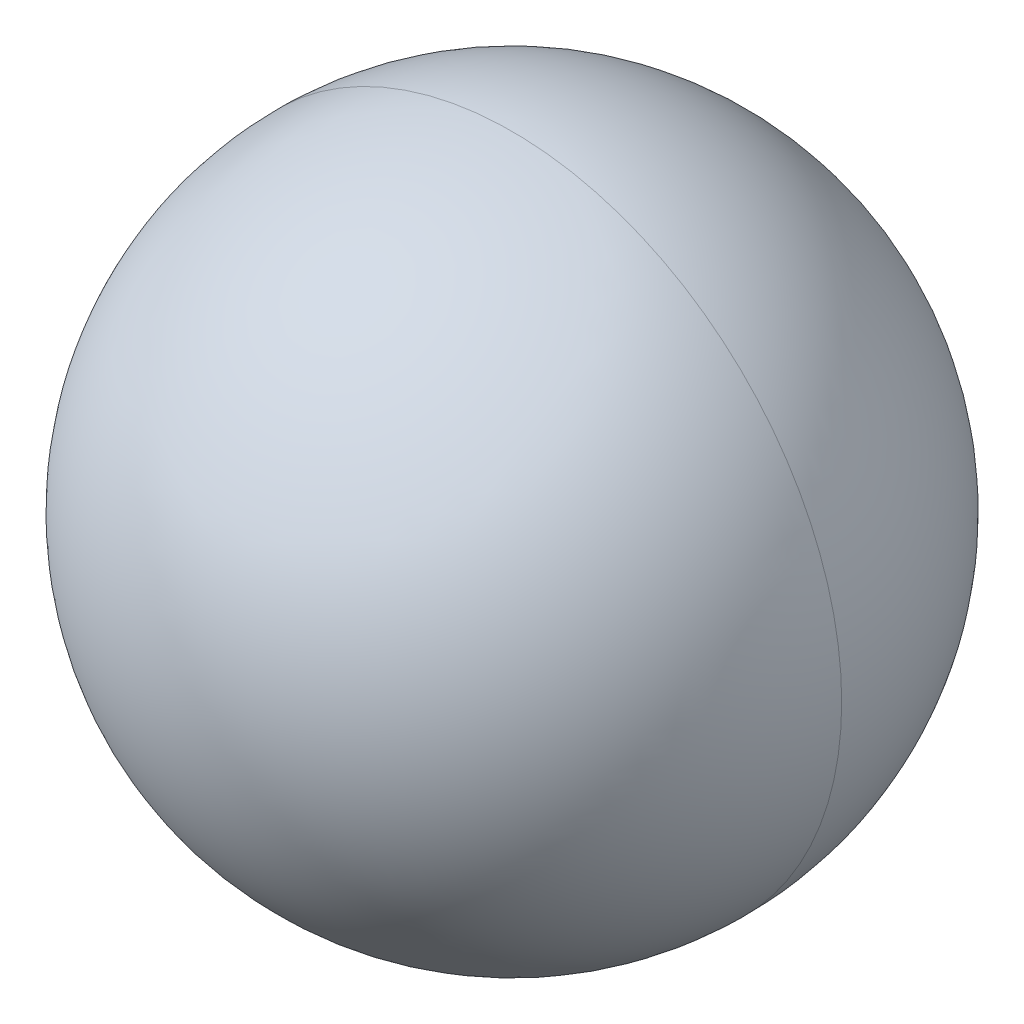
ISO-10303-21;
HEADER;
FILE_DESCRIPTION(('STEP AP214'),'2;1');
FILE_NAME('part.step','',(''),(''),'','','');
FILE_SCHEMA(('AUTOMOTIVE_DESIGN { 1 0 10303 214 1 1 1 1 }'));
ENDSEC;
DATA;
#1=APPLICATION_CONTEXT('core data for automotive mechanical design processes');
#2=APPLICATION_PROTOCOL_DEFINITION('international standard','automotive_design',2000,#1);
#3=PRODUCT_CONTEXT('',#1,'mechanical');
#4=PRODUCT('Part','Part','',(#3));
#5=PRODUCT_RELATED_PRODUCT_CATEGORY('part','',(#4));
#6=PRODUCT_DEFINITION_FORMATION('','',#4);
#7=PRODUCT_DEFINITION_CONTEXT('part definition',#1,'design');
#8=PRODUCT_DEFINITION('design','',#6,#7);
#9=PRODUCT_DEFINITION_SHAPE('','',#8);
#10=(LENGTH_UNIT() NAMED_UNIT(*) SI_UNIT(.MILLI.,.METRE.));
#11=(NAMED_UNIT(*) PLANE_ANGLE_UNIT() SI_UNIT($,.RADIAN.));
#12=(NAMED_UNIT(*) SI_UNIT($,.STERADIAN.) SOLID_ANGLE_UNIT());
#13=UNCERTAINTY_MEASURE_WITH_UNIT(LENGTH_MEASURE(1.E-05),#10,'distance_accuracy_value','');
#14=(GEOMETRIC_REPRESENTATION_CONTEXT(3) GLOBAL_UNCERTAINTY_ASSIGNED_CONTEXT((#13)) GLOBAL_UNIT_ASSIGNED_CONTEXT((#10,
#11,#12)) REPRESENTATION_CONTEXT('',''));
#15=CARTESIAN_POINT('',(0.,0.,0.));
#16=DIRECTION('',(0.,0.,1.));
#17=DIRECTION('',(1.,0.,0.));
#18=AXIS2_PLACEMENT_3D('',#15,#16,#17);
#19=CARTESIAN_POINT('',(5.15,16.75,0.));
#20=DIRECTION('',(1.,0.,0.));
#21=DIRECTION('',(0.,0.,-1.));
#22=AXIS2_PLACEMENT_3D('',#19,#20,#21);
#23=SPHERICAL_SURFACE('',#22,3.969);
#24=CARTESIAN_POINT('',(5.15,16.75,0.));
#25=DIRECTION('',(0.,0.,1.));
#26=DIRECTION('',(1.,0.,0.));
#27=AXIS2_PLACEMENT_3D('',#24,#25,#26);
#28=CIRCLE('',#27,3.969);
#29=CARTESIAN_POINT('',(9.119,16.75,0.));
#30=VERTEX_POINT('',#29);
#31=CARTESIAN_POINT('',(1.181,16.75,0.));
#32=VERTEX_POINT('',#31);
#33=EDGE_CURVE('E11',#30,#32,#28,.T.);
#34=ORIENTED_EDGE('',*,*,#33,.T.);
#35=CARTESIAN_POINT('',(5.15,16.75,0.));
#36=DIRECTION('',(0.,0.,-1.));
#37=DIRECTION('',(1.,0.,0.));
#38=AXIS2_PLACEMENT_3D('',#35,#36,#37);
#39=CIRCLE('',#38,3.969);
#40=EDGE_CURVE('E26',#30,#32,#39,.T.);
#41=ORIENTED_EDGE('',*,*,#40,.F.);
#42=EDGE_LOOP('',(#34,#41));
#43=FACE_BOUND('',#42,.T.);
#44=ADVANCED_FACE('F17',(#43),#23,.T.);
#45=CARTESIAN_POINT('',(5.15,16.75,0.));
#46=DIRECTION('',(1.,0.,0.));
#47=DIRECTION('',(0.,0.,1.));
#48=AXIS2_PLACEMENT_3D('',#45,#46,#47);
#49=SPHERICAL_SURFACE('',#48,3.969);
#50=ORIENTED_EDGE('',*,*,#33,.F.);
#51=ORIENTED_EDGE('',*,*,#40,.T.);
#52=EDGE_LOOP('',(#50,#51));
#53=FACE_BOUND('',#52,.T.);
#54=ADVANCED_FACE('F37',(#53),#49,.T.);
#55=CLOSED_SHELL('',(#44,#54));
#56=MANIFOLD_SOLID_BREP('B1',#55);
#57=ADVANCED_BREP_SHAPE_REPRESENTATION('',(#18,#56),#14);
#58=SHAPE_DEFINITION_REPRESENTATION(#9,#57);
ENDSEC;
END-ISO-10303-21;
